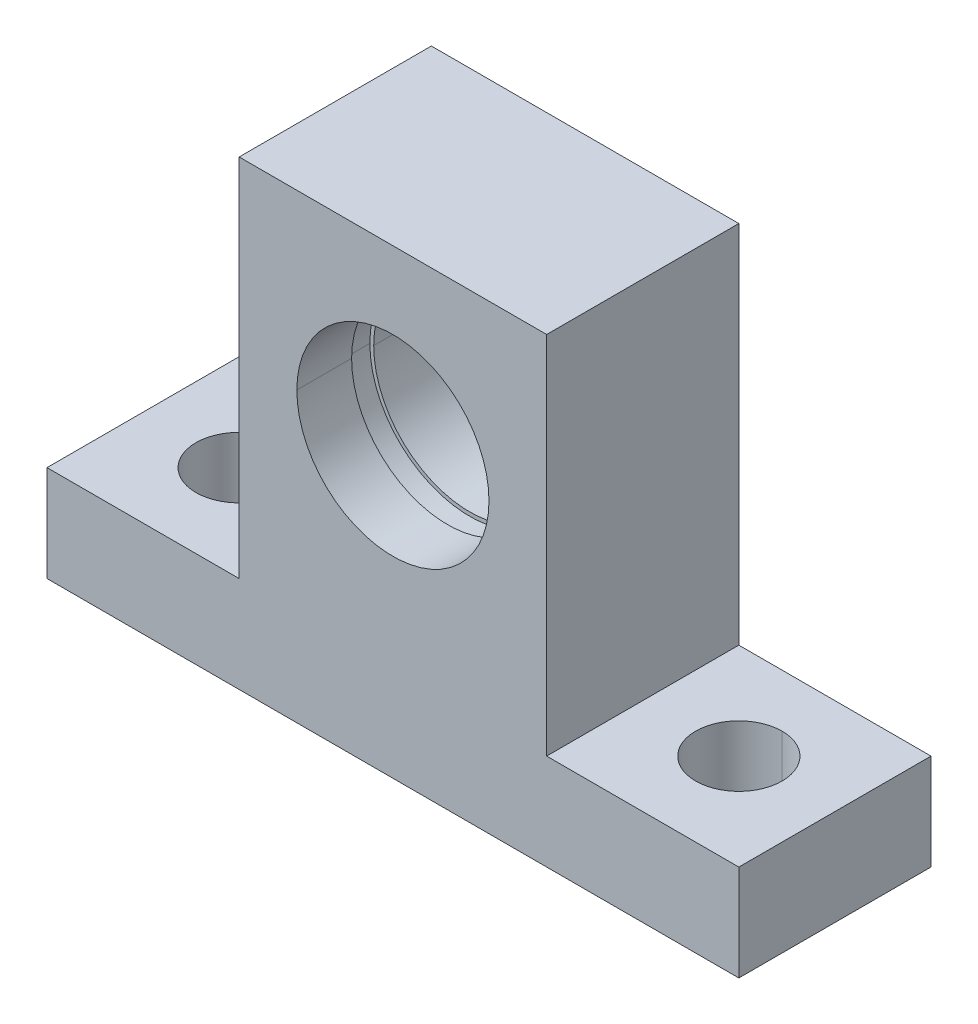
ISO-10303-21;
HEADER;
FILE_DESCRIPTION(('STEP AP214'),'2;1');
FILE_NAME('part.step','',(''),(''),'','','');
FILE_SCHEMA(('AUTOMOTIVE_DESIGN { 1 0 10303 214 1 1 1 1 }'));
ENDSEC;
DATA;
#1=APPLICATION_CONTEXT('core data for automotive mechanical design processes');
#2=APPLICATION_PROTOCOL_DEFINITION('international standard','automotive_design',2000,#1);
#3=PRODUCT_CONTEXT('',#1,'mechanical');
#4=PRODUCT('Part','Part','',(#3));
#5=PRODUCT_RELATED_PRODUCT_CATEGORY('part','',(#4));
#6=PRODUCT_DEFINITION_FORMATION('','',#4);
#7=PRODUCT_DEFINITION_CONTEXT('part definition',#1,'design');
#8=PRODUCT_DEFINITION('design','',#6,#7);
#9=PRODUCT_DEFINITION_SHAPE('','',#8);
#10=(LENGTH_UNIT() NAMED_UNIT(*) SI_UNIT(.MILLI.,.METRE.));
#11=(NAMED_UNIT(*) PLANE_ANGLE_UNIT() SI_UNIT($,.RADIAN.));
#12=(NAMED_UNIT(*) SI_UNIT($,.STERADIAN.) SOLID_ANGLE_UNIT());
#13=UNCERTAINTY_MEASURE_WITH_UNIT(LENGTH_MEASURE(1.E-05),#10,'distance_accuracy_value','');
#14=(GEOMETRIC_REPRESENTATION_CONTEXT(3) GLOBAL_UNCERTAINTY_ASSIGNED_CONTEXT((#13)) GLOBAL_UNIT_ASSIGNED_CONTEXT((#10,
#11,#12)) REPRESENTATION_CONTEXT('',''));
#15=CARTESIAN_POINT('',(0.,0.,0.));
#16=DIRECTION('',(0.,0.,1.));
#17=DIRECTION('',(1.,0.,0.));
#18=AXIS2_PLACEMENT_3D('',#15,#16,#17);
#19=CARTESIAN_POINT('',(0.,0.,-5.));
#20=DIRECTION('',(0.,0.,-1.));
#21=DIRECTION('',(0.,1.,0.));
#22=AXIS2_PLACEMENT_3D('',#19,#20,#21);
#23=CYLINDRICAL_SURFACE('',#22,5.);
#24=DIRECTION('',(0.,0.,-1.));
#25=VECTOR('',#24,1.);
#26=CARTESIAN_POINT('',(5.,0.,5.));
#27=LINE('',#26,#25);
#28=CARTESIAN_POINT('',(5.,0.,5.));
#29=VERTEX_POINT('',#28);
#30=CARTESIAN_POINT('',(5.,0.,2.15));
#31=VERTEX_POINT('',#30);
#32=EDGE_CURVE('E11',#29,#31,#27,.T.);
#33=ORIENTED_EDGE('',*,*,#32,.T.);
#34=CARTESIAN_POINT('',(0.,0.,2.15));
#35=DIRECTION('',(0.,0.,-1.));
#36=DIRECTION('',(-1.,0.,0.));
#37=AXIS2_PLACEMENT_3D('',#34,#35,#36);
#38=CIRCLE('',#37,5.);
#39=CARTESIAN_POINT('',(-5.,0.,2.15));
#40=VERTEX_POINT('',#39);
#41=EDGE_CURVE('E25',#31,#40,#38,.T.);
#42=ORIENTED_EDGE('',*,*,#41,.T.);
#43=DIRECTION('',(0.,0.,-1.));
#44=VECTOR('',#43,1.);
#45=CARTESIAN_POINT('',(-5.,0.,5.));
#46=LINE('',#45,#44);
#47=CARTESIAN_POINT('',(-5.,0.,5.));
#48=VERTEX_POINT('',#47);
#49=EDGE_CURVE('E399',#48,#40,#46,.T.);
#50=ORIENTED_EDGE('',*,*,#49,.F.);
#51=CARTESIAN_POINT('',(0.,0.,5.));
#52=DIRECTION('',(0.,0.,-1.));
#53=DIRECTION('',(-1.,0.,0.));
#54=AXIS2_PLACEMENT_3D('',#51,#52,#53);
#55=CIRCLE('',#54,5.);
#56=EDGE_CURVE('E394',#29,#48,#55,.T.);
#57=ORIENTED_EDGE('',*,*,#56,.F.);
#58=EDGE_LOOP('',(#33,#42,#50,#57));
#59=FACE_BOUND('',#58,.T.);
#60=ADVANCED_FACE('F17',(#59),#23,.F.);
#61=CARTESIAN_POINT('',(0.,0.,5.));
#62=DIRECTION('',(0.,0.,1.));
#63=DIRECTION('',(1.,0.,0.));
#64=AXIS2_PLACEMENT_3D('',#61,#62,#63);
#65=PLANE('',#64);
#66=CARTESIAN_POINT('',(0.,0.,5.));
#67=DIRECTION('',(0.,0.,-1.));
#68=DIRECTION('',(-1.,0.,0.));
#69=AXIS2_PLACEMENT_3D('',#66,#67,#68);
#70=CIRCLE('',#69,5.);
#71=EDGE_CURVE('E389',#48,#29,#70,.T.);
#72=ORIENTED_EDGE('',*,*,#71,.T.);
#73=ORIENTED_EDGE('',*,*,#56,.T.);
#74=EDGE_LOOP('',(#72,#73));
#75=FACE_BOUND('',#74,.T.);
#76=DIRECTION('',(-1.,0.,0.));
#77=VECTOR('',#76,1.);
#78=CARTESIAN_POINT('',(-8.,-10.,5.));
#79=LINE('',#78,#77);
#80=CARTESIAN_POINT('',(-8.,-10.,5.));
#81=VERTEX_POINT('',#80);
#82=CARTESIAN_POINT('',(-18.,-10.,5.));
#83=VERTEX_POINT('',#82);
#84=EDGE_CURVE('E385',#81,#83,#79,.T.);
#85=ORIENTED_EDGE('',*,*,#84,.T.);
#86=DIRECTION('',(0.,-1.,0.));
#87=VECTOR('',#86,1.);
#88=CARTESIAN_POINT('',(-18.,-10.,5.));
#89=LINE('',#88,#87);
#90=CARTESIAN_POINT('',(-18.,-15.,5.));
#91=VERTEX_POINT('',#90);
#92=EDGE_CURVE('E381',#83,#91,#89,.T.);
#93=ORIENTED_EDGE('',*,*,#92,.T.);
#94=DIRECTION('',(1.,0.,0.));
#95=VECTOR('',#94,1.);
#96=CARTESIAN_POINT('',(-18.,-15.,5.));
#97=LINE('',#96,#95);
#98=CARTESIAN_POINT('',(18.,-15.,5.));
#99=VERTEX_POINT('',#98);
#100=EDGE_CURVE('E377',#91,#99,#97,.T.);
#101=ORIENTED_EDGE('',*,*,#100,.T.);
#102=DIRECTION('',(0.,1.,0.));
#103=VECTOR('',#102,1.);
#104=CARTESIAN_POINT('',(18.,-15.,5.));
#105=LINE('',#104,#103);
#106=CARTESIAN_POINT('',(18.,-10.,5.));
#107=VERTEX_POINT('',#106);
#108=EDGE_CURVE('E373',#99,#107,#105,.T.);
#109=ORIENTED_EDGE('',*,*,#108,.T.);
#110=DIRECTION('',(-1.,0.,0.));
#111=VECTOR('',#110,1.);
#112=CARTESIAN_POINT('',(18.,-10.,5.));
#113=LINE('',#112,#111);
#114=CARTESIAN_POINT('',(8.,-10.,5.));
#115=VERTEX_POINT('',#114);
#116=EDGE_CURVE('E369',#107,#115,#113,.T.);
#117=ORIENTED_EDGE('',*,*,#116,.T.);
#118=DIRECTION('',(0.,1.,0.));
#119=VECTOR('',#118,1.);
#120=CARTESIAN_POINT('',(8.,-10.,5.));
#121=LINE('',#120,#119);
#122=CARTESIAN_POINT('',(8.,9.,5.));
#123=VERTEX_POINT('',#122);
#124=EDGE_CURVE('E365',#115,#123,#121,.T.);
#125=ORIENTED_EDGE('',*,*,#124,.T.);
#126=DIRECTION('',(-1.,0.,0.));
#127=VECTOR('',#126,1.);
#128=CARTESIAN_POINT('',(8.,9.,5.));
#129=LINE('',#128,#127);
#130=CARTESIAN_POINT('',(-8.,9.,5.));
#131=VERTEX_POINT('',#130);
#132=EDGE_CURVE('E361',#123,#131,#129,.T.);
#133=ORIENTED_EDGE('',*,*,#132,.T.);
#134=DIRECTION('',(0.,-1.,0.));
#135=VECTOR('',#134,1.);
#136=CARTESIAN_POINT('',(-8.,9.,5.));
#137=LINE('',#136,#135);
#138=EDGE_CURVE('E357',#131,#81,#137,.T.);
#139=ORIENTED_EDGE('',*,*,#138,.T.);
#140=EDGE_LOOP('',(#85,#93,#101,#109,#117,#125,#133,#139));
#141=FACE_BOUND('',#140,.T.);
#142=ADVANCED_FACE('F412',(#75,#141),#65,.T.);
#143=CARTESIAN_POINT('',(-8.,9.,5.));
#144=DIRECTION('',(1.,0.,0.));
#145=DIRECTION('',(0.,0.,-1.));
#146=AXIS2_PLACEMENT_3D('',#143,#144,#145);
#147=PLANE('',#146);
#148=DIRECTION('',(0.,-1.,0.));
#149=VECTOR('',#148,1.);
#150=CARTESIAN_POINT('',(-8.,9.,-5.));
#151=LINE('',#150,#149);
#152=CARTESIAN_POINT('',(-8.,9.,-5.));
#153=VERTEX_POINT('',#152);
#154=CARTESIAN_POINT('',(-8.,-10.,-5.));
#155=VERTEX_POINT('',#154);
#156=EDGE_CURVE('E353',#153,#155,#151,.T.);
#157=ORIENTED_EDGE('',*,*,#156,.T.);
#158=DIRECTION('',(0.,0.,-1.));
#159=VECTOR('',#158,1.);
#160=CARTESIAN_POINT('',(-8.,-10.,5.));
#161=LINE('',#160,#159);
#162=EDGE_CURVE('E348',#81,#155,#161,.T.);
#163=ORIENTED_EDGE('',*,*,#162,.F.);
#164=ORIENTED_EDGE('',*,*,#138,.F.);
#165=DIRECTION('',(0.,0.,-1.));
#166=VECTOR('',#165,1.);
#167=CARTESIAN_POINT('',(-8.,9.,5.));
#168=LINE('',#167,#166);
#169=EDGE_CURVE('E344',#131,#153,#168,.T.);
#170=ORIENTED_EDGE('',*,*,#169,.T.);
#171=EDGE_LOOP('',(#157,#163,#164,#170));
#172=FACE_BOUND('',#171,.T.);
#173=ADVANCED_FACE('F415',(#172),#147,.F.);
#174=CARTESIAN_POINT('',(8.,9.,5.));
#175=DIRECTION('',(0.,-1.,0.));
#176=DIRECTION('',(0.,0.,-1.));
#177=AXIS2_PLACEMENT_3D('',#174,#175,#176);
#178=PLANE('',#177);
#179=DIRECTION('',(-1.,0.,0.));
#180=VECTOR('',#179,1.);
#181=CARTESIAN_POINT('',(8.,9.,-5.));
#182=LINE('',#181,#180);
#183=CARTESIAN_POINT('',(8.,9.,-5.));
#184=VERTEX_POINT('',#183);
#185=EDGE_CURVE('E339',#184,#153,#182,.T.);
#186=ORIENTED_EDGE('',*,*,#185,.T.);
#187=ORIENTED_EDGE('',*,*,#169,.F.);
#188=ORIENTED_EDGE('',*,*,#132,.F.);
#189=DIRECTION('',(0.,0.,-1.));
#190=VECTOR('',#189,1.);
#191=CARTESIAN_POINT('',(8.,9.,5.));
#192=LINE('',#191,#190);
#193=EDGE_CURVE('E335',#123,#184,#192,.T.);
#194=ORIENTED_EDGE('',*,*,#193,.T.);
#195=EDGE_LOOP('',(#186,#187,#188,#194));
#196=FACE_BOUND('',#195,.T.);
#197=ADVANCED_FACE('F452',(#196),#178,.F.);
#198=CARTESIAN_POINT('',(8.,-10.,5.));
#199=DIRECTION('',(-1.,0.,0.));
#200=DIRECTION('',(0.,0.,1.));
#201=AXIS2_PLACEMENT_3D('',#198,#199,#200);
#202=PLANE('',#201);
#203=DIRECTION('',(0.,1.,0.));
#204=VECTOR('',#203,1.);
#205=CARTESIAN_POINT('',(8.,-10.,-5.));
#206=LINE('',#205,#204);
#207=CARTESIAN_POINT('',(8.,-10.,-5.));
#208=VERTEX_POINT('',#207);
#209=EDGE_CURVE('E330',#208,#184,#206,.T.);
#210=ORIENTED_EDGE('',*,*,#209,.T.);
#211=ORIENTED_EDGE('',*,*,#193,.F.);
#212=ORIENTED_EDGE('',*,*,#124,.F.);
#213=DIRECTION('',(0.,0.,-1.));
#214=VECTOR('',#213,1.);
#215=CARTESIAN_POINT('',(8.,-10.,5.));
#216=LINE('',#215,#214);
#217=EDGE_CURVE('E326',#115,#208,#216,.T.);
#218=ORIENTED_EDGE('',*,*,#217,.T.);
#219=EDGE_LOOP('',(#210,#211,#212,#218));
#220=FACE_BOUND('',#219,.T.);
#221=ADVANCED_FACE('F446',(#220),#202,.F.);
#222=CARTESIAN_POINT('',(18.,-10.,5.));
#223=DIRECTION('',(0.,-1.,0.));
#224=DIRECTION('',(0.,0.,-1.));
#225=AXIS2_PLACEMENT_3D('',#222,#223,#224);
#226=PLANE('',#225);
#227=CARTESIAN_POINT('',(13.,-10.,0.));
#228=DIRECTION('',(0.,-1.,0.));
#229=DIRECTION('',(0.,0.,-1.));
#230=AXIS2_PLACEMENT_3D('',#227,#228,#229);
#231=CIRCLE('',#230,2.25);
#232=CARTESIAN_POINT('',(13.,-10.,-2.25));
#233=VERTEX_POINT('',#232);
#234=CARTESIAN_POINT('',(13.,-10.,2.25));
#235=VERTEX_POINT('',#234);
#236=EDGE_CURVE('E322',#233,#235,#231,.T.);
#237=ORIENTED_EDGE('',*,*,#236,.T.);
#238=CARTESIAN_POINT('',(13.,-10.,0.));
#239=DIRECTION('',(0.,-1.,0.));
#240=DIRECTION('',(0.,0.,-1.));
#241=AXIS2_PLACEMENT_3D('',#238,#239,#240);
#242=CIRCLE('',#241,2.25);
#243=EDGE_CURVE('E318',#235,#233,#242,.T.);
#244=ORIENTED_EDGE('',*,*,#243,.T.);
#245=EDGE_LOOP('',(#237,#244));
#246=FACE_BOUND('',#245,.T.);
#247=DIRECTION('',(-1.,0.,0.));
#248=VECTOR('',#247,1.);
#249=CARTESIAN_POINT('',(18.,-10.,-5.));
#250=LINE('',#249,#248);
#251=CARTESIAN_POINT('',(18.,-10.,-5.));
#252=VERTEX_POINT('',#251);
#253=EDGE_CURVE('E313',#252,#208,#250,.T.);
#254=ORIENTED_EDGE('',*,*,#253,.T.);
#255=ORIENTED_EDGE('',*,*,#217,.F.);
#256=ORIENTED_EDGE('',*,*,#116,.F.);
#257=DIRECTION('',(0.,0.,-1.));
#258=VECTOR('',#257,1.);
#259=CARTESIAN_POINT('',(18.,-10.,5.));
#260=LINE('',#259,#258);
#261=EDGE_CURVE('E309',#107,#252,#260,.T.);
#262=ORIENTED_EDGE('',*,*,#261,.T.);
#263=EDGE_LOOP('',(#254,#255,#256,#262));
#264=FACE_BOUND('',#263,.T.);
#265=ADVANCED_FACE('F443',(#246,#264),#226,.F.);
#266=CARTESIAN_POINT('',(18.,-15.,5.));
#267=DIRECTION('',(-1.,0.,0.));
#268=DIRECTION('',(0.,0.,1.));
#269=AXIS2_PLACEMENT_3D('',#266,#267,#268);
#270=PLANE('',#269);
#271=DIRECTION('',(0.,1.,0.));
#272=VECTOR('',#271,1.);
#273=CARTESIAN_POINT('',(18.,-15.,-5.));
#274=LINE('',#273,#272);
#275=CARTESIAN_POINT('',(18.,-15.,-5.));
#276=VERTEX_POINT('',#275);
#277=EDGE_CURVE('E304',#276,#252,#274,.T.);
#278=ORIENTED_EDGE('',*,*,#277,.T.);
#279=ORIENTED_EDGE('',*,*,#261,.F.);
#280=ORIENTED_EDGE('',*,*,#108,.F.);
#281=DIRECTION('',(0.,0.,-1.));
#282=VECTOR('',#281,1.);
#283=CARTESIAN_POINT('',(18.,-15.,5.));
#284=LINE('',#283,#282);
#285=EDGE_CURVE('E300',#99,#276,#284,.T.);
#286=ORIENTED_EDGE('',*,*,#285,.T.);
#287=EDGE_LOOP('',(#278,#279,#280,#286));
#288=FACE_BOUND('',#287,.T.);
#289=ADVANCED_FACE('F438',(#288),#270,.F.);
#290=CARTESIAN_POINT('',(-18.,-15.,5.));
#291=DIRECTION('',(0.,1.,0.));
#292=DIRECTION('',(0.,0.,1.));
#293=AXIS2_PLACEMENT_3D('',#290,#291,#292);
#294=PLANE('',#293);
#295=CARTESIAN_POINT('',(13.,-15.,0.));
#296=DIRECTION('',(0.,-1.,0.));
#297=DIRECTION('',(0.,0.,-1.));
#298=AXIS2_PLACEMENT_3D('',#295,#296,#297);
#299=CIRCLE('',#298,2.25);
#300=CARTESIAN_POINT('',(13.,-15.,2.25));
#301=VERTEX_POINT('',#300);
#302=CARTESIAN_POINT('',(13.,-15.,-2.25));
#303=VERTEX_POINT('',#302);
#304=EDGE_CURVE('E295',#301,#303,#299,.T.);
#305=ORIENTED_EDGE('',*,*,#304,.F.);
#306=CARTESIAN_POINT('',(13.,-15.,0.));
#307=DIRECTION('',(0.,-1.,0.));
#308=DIRECTION('',(0.,0.,-1.));
#309=AXIS2_PLACEMENT_3D('',#306,#307,#308);
#310=CIRCLE('',#309,2.25);
#311=EDGE_CURVE('E290',#303,#301,#310,.T.);
#312=ORIENTED_EDGE('',*,*,#311,.F.);
#313=EDGE_LOOP('',(#305,#312));
#314=FACE_BOUND('',#313,.T.);
#315=CARTESIAN_POINT('',(-13.,-15.,0.));
#316=DIRECTION('',(0.,-1.,0.));
#317=DIRECTION('',(0.,0.,-1.));
#318=AXIS2_PLACEMENT_3D('',#315,#316,#317);
#319=CIRCLE('',#318,2.25);
#320=CARTESIAN_POINT('',(-13.,-15.,2.25));
#321=VERTEX_POINT('',#320);
#322=CARTESIAN_POINT('',(-13.,-15.,-2.25));
#323=VERTEX_POINT('',#322);
#324=EDGE_CURVE('E285',#321,#323,#319,.T.);
#325=ORIENTED_EDGE('',*,*,#324,.F.);
#326=CARTESIAN_POINT('',(-13.,-15.,0.));
#327=DIRECTION('',(0.,-1.,0.));
#328=DIRECTION('',(0.,0.,-1.));
#329=AXIS2_PLACEMENT_3D('',#326,#327,#328);
#330=CIRCLE('',#329,2.25);
#331=EDGE_CURVE('E280',#323,#321,#330,.T.);
#332=ORIENTED_EDGE('',*,*,#331,.F.);
#333=EDGE_LOOP('',(#325,#332));
#334=FACE_BOUND('',#333,.T.);
#335=DIRECTION('',(1.,0.,0.));
#336=VECTOR('',#335,1.);
#337=CARTESIAN_POINT('',(-18.,-15.,-5.));
#338=LINE('',#337,#336);
#339=CARTESIAN_POINT('',(-18.,-15.,-5.));
#340=VERTEX_POINT('',#339);
#341=EDGE_CURVE('E275',#340,#276,#338,.T.);
#342=ORIENTED_EDGE('',*,*,#341,.T.);
#343=ORIENTED_EDGE('',*,*,#285,.F.);
#344=ORIENTED_EDGE('',*,*,#100,.F.);
#345=DIRECTION('',(0.,0.,-1.));
#346=VECTOR('',#345,1.);
#347=CARTESIAN_POINT('',(-18.,-15.,5.));
#348=LINE('',#347,#346);
#349=EDGE_CURVE('E271',#91,#340,#348,.T.);
#350=ORIENTED_EDGE('',*,*,#349,.T.);
#351=EDGE_LOOP('',(#342,#343,#344,#350));
#352=FACE_BOUND('',#351,.T.);
#353=ADVANCED_FACE('F432',(#314,#334,#352),#294,.F.);
#354=CARTESIAN_POINT('',(-18.,-10.,5.));
#355=DIRECTION('',(1.,0.,0.));
#356=DIRECTION('',(0.,0.,-1.));
#357=AXIS2_PLACEMENT_3D('',#354,#355,#356);
#358=PLANE('',#357);
#359=DIRECTION('',(0.,-1.,0.));
#360=VECTOR('',#359,1.);
#361=CARTESIAN_POINT('',(-18.,-10.,-5.));
#362=LINE('',#361,#360);
#363=CARTESIAN_POINT('',(-18.,-10.,-5.));
#364=VERTEX_POINT('',#363);
#365=EDGE_CURVE('E266',#364,#340,#362,.T.);
#366=ORIENTED_EDGE('',*,*,#365,.T.);
#367=ORIENTED_EDGE('',*,*,#349,.F.);
#368=ORIENTED_EDGE('',*,*,#92,.F.);
#369=DIRECTION('',(0.,0.,-1.));
#370=VECTOR('',#369,1.);
#371=CARTESIAN_POINT('',(-18.,-10.,5.));
#372=LINE('',#371,#370);
#373=EDGE_CURVE('E262',#83,#364,#372,.T.);
#374=ORIENTED_EDGE('',*,*,#373,.T.);
#375=EDGE_LOOP('',(#366,#367,#368,#374));
#376=FACE_BOUND('',#375,.T.);
#377=ADVANCED_FACE('F427',(#376),#358,.F.);
#378=CARTESIAN_POINT('',(-8.,-10.,5.));
#379=DIRECTION('',(0.,-1.,0.));
#380=DIRECTION('',(0.,0.,-1.));
#381=AXIS2_PLACEMENT_3D('',#378,#379,#380);
#382=PLANE('',#381);
#383=CARTESIAN_POINT('',(-13.,-10.,0.));
#384=DIRECTION('',(0.,-1.,0.));
#385=DIRECTION('',(0.,0.,-1.));
#386=AXIS2_PLACEMENT_3D('',#383,#384,#385);
#387=CIRCLE('',#386,2.25);
#388=CARTESIAN_POINT('',(-13.,-10.,-2.25));
#389=VERTEX_POINT('',#388);
#390=CARTESIAN_POINT('',(-13.,-10.,2.25));
#391=VERTEX_POINT('',#390);
#392=EDGE_CURVE('E258',#389,#391,#387,.T.);
#393=ORIENTED_EDGE('',*,*,#392,.T.);
#394=CARTESIAN_POINT('',(-13.,-10.,0.));
#395=DIRECTION('',(0.,-1.,0.));
#396=DIRECTION('',(0.,0.,-1.));
#397=AXIS2_PLACEMENT_3D('',#394,#395,#396);
#398=CIRCLE('',#397,2.25);
#399=EDGE_CURVE('E254',#391,#389,#398,.T.);
#400=ORIENTED_EDGE('',*,*,#399,.T.);
#401=EDGE_LOOP('',(#393,#400));
#402=FACE_BOUND('',#401,.T.);
#403=DIRECTION('',(-1.,0.,0.));
#404=VECTOR('',#403,1.);
#405=CARTESIAN_POINT('',(-8.,-10.,-5.));
#406=LINE('',#405,#404);
#407=EDGE_CURVE('E249',#155,#364,#406,.T.);
#408=ORIENTED_EDGE('',*,*,#407,.T.);
#409=ORIENTED_EDGE('',*,*,#373,.F.);
#410=ORIENTED_EDGE('',*,*,#84,.F.);
#411=ORIENTED_EDGE('',*,*,#162,.T.);
#412=EDGE_LOOP('',(#408,#409,#410,#411));
#413=FACE_BOUND('',#412,.T.);
#414=ADVANCED_FACE('F423',(#402,#413),#382,.F.);
#415=CARTESIAN_POINT('',(0.,0.,-5.));
#416=DIRECTION('',(0.,0.,1.));
#417=DIRECTION('',(1.,0.,0.));
#418=AXIS2_PLACEMENT_3D('',#415,#416,#417);
#419=PLANE('',#418);
#420=CARTESIAN_POINT('',(0.,0.,-5.));
#421=DIRECTION('',(0.,0.,-1.));
#422=DIRECTION('',(-1.,0.,0.));
#423=AXIS2_PLACEMENT_3D('',#420,#421,#422);
#424=CIRCLE('',#423,3.5);
#425=CARTESIAN_POINT('',(3.5,0.,-5.));
#426=VERTEX_POINT('',#425);
#427=CARTESIAN_POINT('',(-3.5,0.,-5.));
#428=VERTEX_POINT('',#427);
#429=EDGE_CURVE('E244',#426,#428,#424,.T.);
#430=ORIENTED_EDGE('',*,*,#429,.F.);
#431=CARTESIAN_POINT('',(0.,0.,-5.));
#432=DIRECTION('',(0.,0.,-1.));
#433=DIRECTION('',(-1.,0.,0.));
#434=AXIS2_PLACEMENT_3D('',#431,#432,#433);
#435=CIRCLE('',#434,3.5);
#436=EDGE_CURVE('E239',#428,#426,#435,.T.);
#437=ORIENTED_EDGE('',*,*,#436,.F.);
#438=EDGE_LOOP('',(#430,#437));
#439=FACE_BOUND('',#438,.T.);
#440=ORIENTED_EDGE('',*,*,#407,.F.);
#441=ORIENTED_EDGE('',*,*,#156,.F.);
#442=ORIENTED_EDGE('',*,*,#185,.F.);
#443=ORIENTED_EDGE('',*,*,#209,.F.);
#444=ORIENTED_EDGE('',*,*,#253,.F.);
#445=ORIENTED_EDGE('',*,*,#277,.F.);
#446=ORIENTED_EDGE('',*,*,#341,.F.);
#447=ORIENTED_EDGE('',*,*,#365,.F.);
#448=EDGE_LOOP('',(#440,#441,#442,#443,#444,#445,#446,#447));
#449=FACE_BOUND('',#448,.T.);
#450=ADVANCED_FACE('F456',(#439,#449),#419,.F.);
#451=CARTESIAN_POINT('',(0.,0.,-5.));
#452=DIRECTION('',(0.,0.,-1.));
#453=DIRECTION('',(0.,-1.,0.));
#454=AXIS2_PLACEMENT_3D('',#451,#452,#453);
#455=CYLINDRICAL_SURFACE('',#454,3.5);
#456=DIRECTION('',(0.,0.,-1.));
#457=VECTOR('',#456,1.);
#458=CARTESIAN_POINT('',(3.5,0.,-3.));
#459=LINE('',#458,#457);
#460=CARTESIAN_POINT('',(3.5,0.,-3.));
#461=VERTEX_POINT('',#460);
#462=EDGE_CURVE('E234',#461,#426,#459,.T.);
#463=ORIENTED_EDGE('',*,*,#462,.F.);
#464=CARTESIAN_POINT('',(0.,0.,-3.));
#465=DIRECTION('',(0.,0.,-1.));
#466=DIRECTION('',(-1.,0.,0.));
#467=AXIS2_PLACEMENT_3D('',#464,#465,#466);
#468=CIRCLE('',#467,3.5);
#469=CARTESIAN_POINT('',(-3.5,0.,-3.));
#470=VERTEX_POINT('',#469);
#471=EDGE_CURVE('E229',#470,#461,#468,.T.);
#472=ORIENTED_EDGE('',*,*,#471,.F.);
#473=DIRECTION('',(0.,0.,-1.));
#474=VECTOR('',#473,1.);
#475=CARTESIAN_POINT('',(-3.5,0.,-3.));
#476=LINE('',#475,#474);
#477=EDGE_CURVE('E224',#470,#428,#476,.T.);
#478=ORIENTED_EDGE('',*,*,#477,.T.);
#479=ORIENTED_EDGE('',*,*,#436,.T.);
#480=EDGE_LOOP('',(#463,#472,#478,#479));
#481=FACE_BOUND('',#480,.T.);
#482=ADVANCED_FACE('F458',(#481),#455,.F.);
#483=CARTESIAN_POINT('',(0.,0.,-5.));
#484=DIRECTION('',(0.,0.,-1.));
#485=DIRECTION('',(0.,1.,0.));
#486=AXIS2_PLACEMENT_3D('',#483,#484,#485);
#487=CYLINDRICAL_SURFACE('',#486,3.5);
#488=ORIENTED_EDGE('',*,*,#462,.T.);
#489=ORIENTED_EDGE('',*,*,#429,.T.);
#490=ORIENTED_EDGE('',*,*,#477,.F.);
#491=CARTESIAN_POINT('',(0.,0.,-3.));
#492=DIRECTION('',(0.,0.,-1.));
#493=DIRECTION('',(-1.,0.,0.));
#494=AXIS2_PLACEMENT_3D('',#491,#492,#493);
#495=CIRCLE('',#494,3.5);
#496=EDGE_CURVE('E219',#461,#470,#495,.T.);
#497=ORIENTED_EDGE('',*,*,#496,.F.);
#498=EDGE_LOOP('',(#488,#489,#490,#497));
#499=FACE_BOUND('',#498,.T.);
#500=ADVANCED_FACE('F466',(#499),#487,.F.);
#501=CARTESIAN_POINT('',(0.,5.,-3.));
#502=DIRECTION('',(0.,0.,1.));
#503=DIRECTION('',(1.,0.,0.));
#504=AXIS2_PLACEMENT_3D('',#501,#502,#503);
#505=PLANE('',#504);
#506=ORIENTED_EDGE('',*,*,#471,.T.);
#507=ORIENTED_EDGE('',*,*,#496,.T.);
#508=EDGE_LOOP('',(#506,#507));
#509=FACE_BOUND('',#508,.T.);
#510=CARTESIAN_POINT('',(0.,0.,-3.));
#511=DIRECTION('',(0.,0.,-1.));
#512=DIRECTION('',(-1.,0.,0.));
#513=AXIS2_PLACEMENT_3D('',#510,#511,#512);
#514=CIRCLE('',#513,5.);
#515=CARTESIAN_POINT('',(5.,0.,-3.));
#516=VERTEX_POINT('',#515);
#517=CARTESIAN_POINT('',(-5.,0.,-3.));
#518=VERTEX_POINT('',#517);
#519=EDGE_CURVE('E214',#516,#518,#514,.T.);
#520=ORIENTED_EDGE('',*,*,#519,.F.);
#521=CARTESIAN_POINT('',(0.,0.,-3.));
#522=DIRECTION('',(0.,0.,-1.));
#523=DIRECTION('',(-1.,0.,0.));
#524=AXIS2_PLACEMENT_3D('',#521,#522,#523);
#525=CIRCLE('',#524,5.);
#526=EDGE_CURVE('E209',#518,#516,#525,.T.);
#527=ORIENTED_EDGE('',*,*,#526,.F.);
#528=EDGE_LOOP('',(#520,#527));
#529=FACE_BOUND('',#528,.T.);
#530=ADVANCED_FACE('F553',(#509,#529),#505,.T.);
#531=CARTESIAN_POINT('',(0.,0.,-5.));
#532=DIRECTION('',(0.,0.,-1.));
#533=DIRECTION('',(0.,-1.,0.));
#534=AXIS2_PLACEMENT_3D('',#531,#532,#533);
#535=CYLINDRICAL_SURFACE('',#534,5.);
#536=DIRECTION('',(0.,0.,-1.));
#537=VECTOR('',#536,1.);
#538=CARTESIAN_POINT('',(5.,0.,1.));
#539=LINE('',#538,#537);
#540=CARTESIAN_POINT('',(5.,0.,1.));
#541=VERTEX_POINT('',#540);
#542=EDGE_CURVE('E204',#541,#516,#539,.T.);
#543=ORIENTED_EDGE('',*,*,#542,.F.);
#544=CARTESIAN_POINT('',(0.,0.,1.));
#545=DIRECTION('',(0.,0.,1.));
#546=DIRECTION('',(1.,0.,0.));
#547=AXIS2_PLACEMENT_3D('',#544,#545,#546);
#548=CIRCLE('',#547,5.);
#549=CARTESIAN_POINT('',(-5.,0.,1.));
#550=VERTEX_POINT('',#549);
#551=EDGE_CURVE('E200',#541,#550,#548,.T.);
#552=ORIENTED_EDGE('',*,*,#551,.T.);
#553=DIRECTION('',(0.,0.,-1.));
#554=VECTOR('',#553,1.);
#555=CARTESIAN_POINT('',(-5.,0.,1.));
#556=LINE('',#555,#554);
#557=EDGE_CURVE('E195',#550,#518,#556,.T.);
#558=ORIENTED_EDGE('',*,*,#557,.T.);
#559=ORIENTED_EDGE('',*,*,#526,.T.);
#560=EDGE_LOOP('',(#543,#552,#558,#559));
#561=FACE_BOUND('',#560,.T.);
#562=ADVANCED_FACE('F564',(#561),#535,.F.);
#563=CARTESIAN_POINT('',(0.,0.,-5.));
#564=DIRECTION('',(0.,0.,-1.));
#565=DIRECTION('',(0.,1.,0.));
#566=AXIS2_PLACEMENT_3D('',#563,#564,#565);
#567=CYLINDRICAL_SURFACE('',#566,5.);
#568=ORIENTED_EDGE('',*,*,#542,.T.);
#569=ORIENTED_EDGE('',*,*,#519,.T.);
#570=ORIENTED_EDGE('',*,*,#557,.F.);
#571=CARTESIAN_POINT('',(0.,0.,1.));
#572=DIRECTION('',(0.,0.,1.));
#573=DIRECTION('',(1.,0.,0.));
#574=AXIS2_PLACEMENT_3D('',#571,#572,#573);
#575=CIRCLE('',#574,5.);
#576=EDGE_CURVE('E190',#550,#541,#575,.T.);
#577=ORIENTED_EDGE('',*,*,#576,.T.);
#578=EDGE_LOOP('',(#568,#569,#570,#577));
#579=FACE_BOUND('',#578,.T.);
#580=ADVANCED_FACE('F575',(#579),#567,.F.);
#581=CARTESIAN_POINT('',(0.,5.2,1.));
#582=DIRECTION('',(0.,0.,1.));
#583=DIRECTION('',(1.,0.,0.));
#584=AXIS2_PLACEMENT_3D('',#581,#582,#583);
#585=PLANE('',#584);
#586=ORIENTED_EDGE('',*,*,#576,.F.);
#587=ORIENTED_EDGE('',*,*,#551,.F.);
#588=EDGE_LOOP('',(#586,#587));
#589=FACE_BOUND('',#588,.T.);
#590=CARTESIAN_POINT('',(0.,0.,1.));
#591=DIRECTION('',(0.,0.,-1.));
#592=DIRECTION('',(-1.,0.,0.));
#593=AXIS2_PLACEMENT_3D('',#590,#591,#592);
#594=CIRCLE('',#593,5.2);
#595=CARTESIAN_POINT('',(5.2,0.,1.));
#596=VERTEX_POINT('',#595);
#597=CARTESIAN_POINT('',(-5.2,0.,1.));
#598=VERTEX_POINT('',#597);
#599=EDGE_CURVE('E165',#596,#598,#594,.T.);
#600=ORIENTED_EDGE('',*,*,#599,.F.);
#601=CARTESIAN_POINT('',(0.,0.,1.));
#602=DIRECTION('',(0.,0.,-1.));
#603=DIRECTION('',(-1.,0.,0.));
#604=AXIS2_PLACEMENT_3D('',#601,#602,#603);
#605=CIRCLE('',#604,5.2);
#606=EDGE_CURVE('E183',#598,#596,#605,.T.);
#607=ORIENTED_EDGE('',*,*,#606,.F.);
#608=EDGE_LOOP('',(#600,#607));
#609=FACE_BOUND('',#608,.T.);
#610=ADVANCED_FACE('F586',(#589,#609),#585,.T.);
#611=CARTESIAN_POINT('',(0.,0.,1.));
#612=DIRECTION('',(0.,0.,-1.));
#613=DIRECTION('',(0.,-1.,0.));
#614=AXIS2_PLACEMENT_3D('',#611,#612,#613);
#615=CYLINDRICAL_SURFACE('',#614,5.2);
#616=DIRECTION('',(0.,0.,-1.));
#617=VECTOR('',#616,1.);
#618=CARTESIAN_POINT('',(5.2,0.,2.15));
#619=LINE('',#618,#617);
#620=CARTESIAN_POINT('',(5.2,0.,2.15));
#621=VERTEX_POINT('',#620);
#622=EDGE_CURVE('E157',#621,#596,#619,.T.);
#623=ORIENTED_EDGE('',*,*,#622,.F.);
#624=CARTESIAN_POINT('',(0.,0.,2.15));
#625=DIRECTION('',(0.,0.,-1.));
#626=DIRECTION('',(-1.,0.,0.));
#627=AXIS2_PLACEMENT_3D('',#624,#625,#626);
#628=CIRCLE('',#627,5.2);
#629=CARTESIAN_POINT('',(-5.2,0.,2.15));
#630=VERTEX_POINT('',#629);
#631=EDGE_CURVE('E150',#630,#621,#628,.T.);
#632=ORIENTED_EDGE('',*,*,#631,.F.);
#633=DIRECTION('',(0.,0.,-1.));
#634=VECTOR('',#633,1.);
#635=CARTESIAN_POINT('',(-5.2,0.,2.15));
#636=LINE('',#635,#634);
#637=EDGE_CURVE('E154',#630,#598,#636,.T.);
#638=ORIENTED_EDGE('',*,*,#637,.T.);
#639=ORIENTED_EDGE('',*,*,#606,.T.);
#640=EDGE_LOOP('',(#623,#632,#638,#639));
#641=FACE_BOUND('',#640,.T.);
#642=ADVANCED_FACE('F152',(#641),#615,.F.);
#643=CARTESIAN_POINT('',(0.,0.,1.));
#644=DIRECTION('',(0.,0.,-1.));
#645=DIRECTION('',(0.,1.,0.));
#646=AXIS2_PLACEMENT_3D('',#643,#644,#645);
#647=CYLINDRICAL_SURFACE('',#646,5.2);
#648=ORIENTED_EDGE('',*,*,#622,.T.);
#649=ORIENTED_EDGE('',*,*,#599,.T.);
#650=ORIENTED_EDGE('',*,*,#637,.F.);
#651=CARTESIAN_POINT('',(0.,0.,2.15));
#652=DIRECTION('',(0.,0.,-1.));
#653=DIRECTION('',(-1.,0.,0.));
#654=AXIS2_PLACEMENT_3D('',#651,#652,#653);
#655=CIRCLE('',#654,5.2);
#656=EDGE_CURVE('E164',#621,#630,#655,.T.);
#657=ORIENTED_EDGE('',*,*,#656,.F.);
#658=EDGE_LOOP('',(#648,#649,#650,#657));
#659=FACE_BOUND('',#658,.T.);
#660=ADVANCED_FACE('F163',(#659),#647,.F.);
#661=CARTESIAN_POINT('',(0.,0.,2.15));
#662=DIRECTION('',(0.,0.,-1.));
#663=DIRECTION('',(-1.,0.,0.));
#664=AXIS2_PLACEMENT_3D('',#661,#662,#663);
#665=PLANE('',#664);
#666=ORIENTED_EDGE('',*,*,#631,.T.);
#667=ORIENTED_EDGE('',*,*,#656,.T.);
#668=EDGE_LOOP('',(#666,#667));
#669=FACE_BOUND('',#668,.T.);
#670=ORIENTED_EDGE('',*,*,#41,.F.);
#671=CARTESIAN_POINT('',(0.,0.,2.15));
#672=DIRECTION('',(0.,0.,-1.));
#673=DIRECTION('',(-1.,0.,0.));
#674=AXIS2_PLACEMENT_3D('',#671,#672,#673);
#675=CIRCLE('',#674,5.);
#676=EDGE_CURVE('E169',#40,#31,#675,.T.);
#677=ORIENTED_EDGE('',*,*,#676,.F.);
#678=EDGE_LOOP('',(#670,#677));
#679=FACE_BOUND('',#678,.T.);
#680=ADVANCED_FACE('F167',(#669,#679),#665,.T.);
#681=CARTESIAN_POINT('',(0.,0.,-5.));
#682=DIRECTION('',(0.,0.,-1.));
#683=DIRECTION('',(0.,-1.,0.));
#684=AXIS2_PLACEMENT_3D('',#681,#682,#683);
#685=CYLINDRICAL_SURFACE('',#684,5.);
#686=ORIENTED_EDGE('',*,*,#32,.F.);
#687=ORIENTED_EDGE('',*,*,#71,.F.);
#688=ORIENTED_EDGE('',*,*,#49,.T.);
#689=ORIENTED_EDGE('',*,*,#676,.T.);
#690=EDGE_LOOP('',(#686,#687,#688,#689));
#691=FACE_BOUND('',#690,.T.);
#692=ADVANCED_FACE('F410',(#691),#685,.F.);
#693=CARTESIAN_POINT('',(-13.,-15.,0.));
#694=DIRECTION('',(0.,-1.,0.));
#695=DIRECTION('',(1.,0.,0.));
#696=AXIS2_PLACEMENT_3D('',#693,#694,#695);
#697=CYLINDRICAL_SURFACE('',#696,2.25);
#698=DIRECTION('',(0.,-1.,0.));
#699=VECTOR('',#698,1.);
#700=CARTESIAN_POINT('',(-13.,-10.,2.25));
#701=LINE('',#700,#699);
#702=EDGE_CURVE('E171',#391,#321,#701,.T.);
#703=ORIENTED_EDGE('',*,*,#702,.T.);
#704=ORIENTED_EDGE('',*,*,#324,.T.);
#705=DIRECTION('',(0.,-1.,0.));
#706=VECTOR('',#705,1.);
#707=CARTESIAN_POINT('',(-13.,-10.,-2.25));
#708=LINE('',#707,#706);
#709=EDGE_CURVE('E744',#389,#323,#708,.T.);
#710=ORIENTED_EDGE('',*,*,#709,.F.);
#711=ORIENTED_EDGE('',*,*,#399,.F.);
#712=EDGE_LOOP('',(#703,#704,#710,#711));
#713=FACE_BOUND('',#712,.T.);
#714=ADVANCED_FACE('F634',(#713),#697,.F.);
#715=CARTESIAN_POINT('',(-13.,-15.,0.));
#716=DIRECTION('',(0.,-1.,0.));
#717=DIRECTION('',(-1.,0.,0.));
#718=AXIS2_PLACEMENT_3D('',#715,#716,#717);
#719=CYLINDRICAL_SURFACE('',#718,2.25);
#720=ORIENTED_EDGE('',*,*,#702,.F.);
#721=ORIENTED_EDGE('',*,*,#392,.F.);
#722=ORIENTED_EDGE('',*,*,#709,.T.);
#723=ORIENTED_EDGE('',*,*,#331,.T.);
#724=EDGE_LOOP('',(#720,#721,#722,#723));
#725=FACE_BOUND('',#724,.T.);
#726=ADVANCED_FACE('F644',(#725),#719,.F.);
#727=CARTESIAN_POINT('',(13.,-15.,0.));
#728=DIRECTION('',(0.,-1.,0.));
#729=DIRECTION('',(-1.,0.,0.));
#730=AXIS2_PLACEMENT_3D('',#727,#728,#729);
#731=CYLINDRICAL_SURFACE('',#730,2.25);
#732=DIRECTION('',(0.,-1.,0.));
#733=VECTOR('',#732,1.);
#734=CARTESIAN_POINT('',(13.,-10.,2.25));
#735=LINE('',#734,#733);
#736=EDGE_CURVE('E741',#235,#301,#735,.T.);
#737=ORIENTED_EDGE('',*,*,#736,.F.);
#738=ORIENTED_EDGE('',*,*,#236,.F.);
#739=DIRECTION('',(0.,-1.,0.));
#740=VECTOR('',#739,1.);
#741=CARTESIAN_POINT('',(13.,-10.,-2.25));
#742=LINE('',#741,#740);
#743=EDGE_CURVE('E745',#233,#303,#742,.T.);
#744=ORIENTED_EDGE('',*,*,#743,.T.);
#745=ORIENTED_EDGE('',*,*,#311,.T.);
#746=EDGE_LOOP('',(#737,#738,#744,#745));
#747=FACE_BOUND('',#746,.T.);
#748=ADVANCED_FACE('F655',(#747),#731,.F.);
#749=CARTESIAN_POINT('',(13.,-15.,0.));
#750=DIRECTION('',(0.,-1.,0.));
#751=DIRECTION('',(1.,0.,0.));
#752=AXIS2_PLACEMENT_3D('',#749,#750,#751);
#753=CYLINDRICAL_SURFACE('',#752,2.25);
#754=ORIENTED_EDGE('',*,*,#736,.T.);
#755=ORIENTED_EDGE('',*,*,#304,.T.);
#756=ORIENTED_EDGE('',*,*,#743,.F.);
#757=ORIENTED_EDGE('',*,*,#243,.F.);
#758=EDGE_LOOP('',(#754,#755,#756,#757));
#759=FACE_BOUND('',#758,.T.);
#760=ADVANCED_FACE('F666',(#759),#753,.F.);
#761=CLOSED_SHELL('',(#60,#142,#173,#197,#221,#265,#289,#353,#377,#414,#450,#482,#500,#530,#562,
#580,#610,#642,#660,#680,#692,#714,#726,#748,#760));
#762=MANIFOLD_SOLID_BREP('B1',#761);
#763=ADVANCED_BREP_SHAPE_REPRESENTATION('',(#18,#762),#14);
#764=SHAPE_DEFINITION_REPRESENTATION(#9,#763);
ENDSEC;
END-ISO-10303-21;
